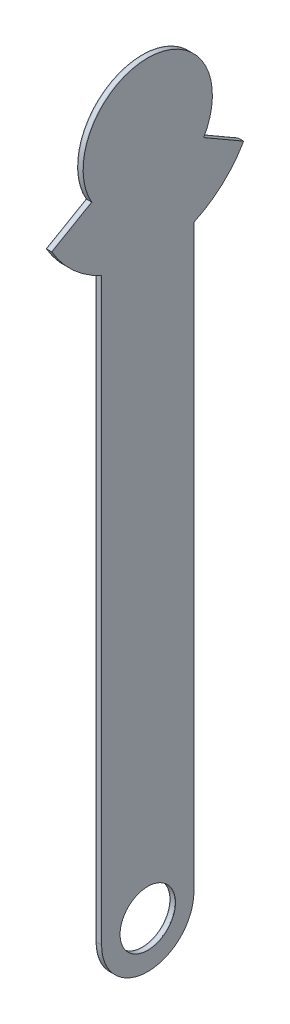
ISO-10303-21;
HEADER;
FILE_DESCRIPTION(('STEP AP214'),'2;1');
FILE_NAME('part.step','',(''),(''),'','','');
FILE_SCHEMA(('AUTOMOTIVE_DESIGN { 1 0 10303 214 1 1 1 1 }'));
ENDSEC;
DATA;
#1=APPLICATION_CONTEXT('core data for automotive mechanical design processes');
#2=APPLICATION_PROTOCOL_DEFINITION('international standard','automotive_design',2000,#1);
#3=PRODUCT_CONTEXT('',#1,'mechanical');
#4=PRODUCT('Part','Part','',(#3));
#5=PRODUCT_RELATED_PRODUCT_CATEGORY('part','',(#4));
#6=PRODUCT_DEFINITION_FORMATION('','',#4);
#7=PRODUCT_DEFINITION_CONTEXT('part definition',#1,'design');
#8=PRODUCT_DEFINITION('design','',#6,#7);
#9=PRODUCT_DEFINITION_SHAPE('','',#8);
#10=(LENGTH_UNIT() NAMED_UNIT(*) SI_UNIT(.MILLI.,.METRE.));
#11=(NAMED_UNIT(*) PLANE_ANGLE_UNIT() SI_UNIT($,.RADIAN.));
#12=(NAMED_UNIT(*) SI_UNIT($,.STERADIAN.) SOLID_ANGLE_UNIT());
#13=UNCERTAINTY_MEASURE_WITH_UNIT(LENGTH_MEASURE(1.E-05),#10,'distance_accuracy_value','');
#14=(GEOMETRIC_REPRESENTATION_CONTEXT(3) GLOBAL_UNCERTAINTY_ASSIGNED_CONTEXT((#13)) GLOBAL_UNIT_ASSIGNED_CONTEXT((#10,
#11,#12)) REPRESENTATION_CONTEXT('',''));
#15=CARTESIAN_POINT('',(0.,0.,0.));
#16=DIRECTION('',(0.,0.,1.));
#17=DIRECTION('',(1.,0.,0.));
#18=AXIS2_PLACEMENT_3D('',#15,#16,#17);
#19=CARTESIAN_POINT('',(-2.75,196.8,0.));
#20=DIRECTION('',(1.,0.,0.));
#21=DIRECTION('',(0.,0.,-1.));
#22=AXIS2_PLACEMENT_3D('',#19,#20,#21);
#23=CYLINDRICAL_SURFACE('',#22,60.);
#24=CARTESIAN_POINT('',(-2.5,196.8,0.));
#25=DIRECTION('',(-1.,0.,0.));
#26=DIRECTION('',(0.,0.,1.));
#27=AXIS2_PLACEMENT_3D('',#24,#25,#26);
#28=CIRCLE('',#27,60.);
#29=CARTESIAN_POINT('',(-2.5,142.256439426821,25.));
#30=VERTEX_POINT('',#29);
#31=CARTESIAN_POINT('',(-2.5,166.8,51.9615242270665));
#32=VERTEX_POINT('',#31);
#33=EDGE_CURVE('E160',#30,#32,#28,.T.);
#34=ORIENTED_EDGE('',*,*,#33,.T.);
#35=DIRECTION('',(1.,0.,0.));
#36=VECTOR('',#35,1.);
#37=CARTESIAN_POINT('',(-2.75,166.8,51.9615242270665));
#38=LINE('',#37,#36);
#39=CARTESIAN_POINT('',(-2.75,166.8,51.9615242270665));
#40=VERTEX_POINT('',#39);
#41=EDGE_CURVE('E12',#40,#32,#38,.T.);
#42=ORIENTED_EDGE('',*,*,#41,.F.);
#43=CARTESIAN_POINT('',(-2.75,196.8,0.));
#44=DIRECTION('',(-1.,0.,0.));
#45=DIRECTION('',(0.,0.,1.));
#46=AXIS2_PLACEMENT_3D('',#43,#44,#45);
#47=CIRCLE('',#46,60.);
#48=CARTESIAN_POINT('',(-2.75,142.256439426821,25.));
#49=VERTEX_POINT('',#48);
#50=EDGE_CURVE('E206',#49,#40,#47,.T.);
#51=ORIENTED_EDGE('',*,*,#50,.F.);
#52=DIRECTION('',(1.,0.,0.));
#53=VECTOR('',#52,1.);
#54=CARTESIAN_POINT('',(-2.75,142.256439426821,25.));
#55=LINE('',#54,#53);
#56=EDGE_CURVE('E153',#49,#30,#55,.T.);
#57=ORIENTED_EDGE('',*,*,#56,.T.);
#58=EDGE_LOOP('',(#34,#42,#51,#57));
#59=FACE_BOUND('',#58,.T.);
#60=ADVANCED_FACE('F60',(#59),#23,.T.);
#61=CARTESIAN_POINT('',(-2.75,147.600000000001,85.2168997323883));
#62=DIRECTION('',(0.,-0.866025403784441,-0.499999999999995));
#63=DIRECTION('',(0.,0.499999999999995,-0.866025403784442));
#64=AXIS2_PLACEMENT_3D('',#61,#62,#63);
#65=PLANE('',#64);
#66=DIRECTION('',(0.,0.499999999999995,-0.866025403784442));
#67=VECTOR('',#66,1.);
#68=CARTESIAN_POINT('',(-2.5,147.600000000001,85.2168997323883));
#69=LINE('',#68,#67);
#70=CARTESIAN_POINT('',(-2.5,179.3,30.3108891324555));
#71=VERTEX_POINT('',#70);
#72=EDGE_CURVE('E163',#32,#71,#69,.T.);
#73=ORIENTED_EDGE('',*,*,#72,.T.);
#74=DIRECTION('',(1.,0.,0.));
#75=VECTOR('',#74,1.);
#76=CARTESIAN_POINT('',(-2.75,179.3,30.3108891324555));
#77=LINE('',#76,#75);
#78=CARTESIAN_POINT('',(-2.75,179.3,30.3108891324555));
#79=VERTEX_POINT('',#78);
#80=EDGE_CURVE('E69',#79,#71,#77,.T.);
#81=ORIENTED_EDGE('',*,*,#80,.F.);
#82=DIRECTION('',(0.,0.499999999999995,-0.866025403784442));
#83=VECTOR('',#82,1.);
#84=CARTESIAN_POINT('',(-2.75,147.600000000001,85.2168997323883));
#85=LINE('',#84,#83);
#86=EDGE_CURVE('E120',#40,#79,#85,.T.);
#87=ORIENTED_EDGE('',*,*,#86,.F.);
#88=ORIENTED_EDGE('',*,*,#41,.T.);
#89=EDGE_LOOP('',(#73,#81,#87,#88));
#90=FACE_BOUND('',#89,.T.);
#91=ADVANCED_FACE('F225',(#90),#65,.F.);
#92=CARTESIAN_POINT('',(-2.75,196.8,0.));
#93=DIRECTION('',(1.,0.,0.));
#94=DIRECTION('',(0.,0.,-1.));
#95=AXIS2_PLACEMENT_3D('',#92,#93,#94);
#96=CYLINDRICAL_SURFACE('',#95,35.);
#97=CARTESIAN_POINT('',(-2.5,196.8,0.));
#98=DIRECTION('',(-1.,0.,0.));
#99=DIRECTION('',(0.,0.,1.));
#100=AXIS2_PLACEMENT_3D('',#97,#98,#99);
#101=CIRCLE('',#100,35.);
#102=CARTESIAN_POINT('',(-2.5,179.3,-30.3108891324553));
#103=VERTEX_POINT('',#102);
#104=EDGE_CURVE('E165',#71,#103,#101,.T.);
#105=ORIENTED_EDGE('',*,*,#104,.T.);
#106=DIRECTION('',(1.,0.,0.));
#107=VECTOR('',#106,1.);
#108=CARTESIAN_POINT('',(-2.75,179.3,-30.3108891324553));
#109=LINE('',#108,#107);
#110=CARTESIAN_POINT('',(-2.75,179.3,-30.3108891324553));
#111=VERTEX_POINT('',#110);
#112=EDGE_CURVE('E181',#111,#103,#109,.T.);
#113=ORIENTED_EDGE('',*,*,#112,.F.);
#114=CARTESIAN_POINT('',(-2.75,196.8,0.));
#115=DIRECTION('',(-1.,0.,0.));
#116=DIRECTION('',(0.,0.,1.));
#117=AXIS2_PLACEMENT_3D('',#114,#115,#116);
#118=CIRCLE('',#117,35.);
#119=EDGE_CURVE('E189',#79,#111,#118,.T.);
#120=ORIENTED_EDGE('',*,*,#119,.F.);
#121=ORIENTED_EDGE('',*,*,#80,.T.);
#122=EDGE_LOOP('',(#105,#113,#120,#121));
#123=FACE_BOUND('',#122,.T.);
#124=ADVANCED_FACE('F187',(#123),#96,.T.);
#125=CARTESIAN_POINT('',(-2.75,147.6,-85.2168997323889));
#126=DIRECTION('',(0.,-0.866025403784438,0.500000000000001));
#127=DIRECTION('',(0.,-0.500000000000001,-0.866025403784438));
#128=AXIS2_PLACEMENT_3D('',#125,#126,#127);
#129=PLANE('',#128);
#130=DIRECTION('',(0.,-0.500000000000001,-0.866025403784438));
#131=VECTOR('',#130,1.);
#132=CARTESIAN_POINT('',(-2.5,147.6,-85.2168997323889));
#133=LINE('',#132,#131);
#134=CARTESIAN_POINT('',(-2.5,166.8,-51.9615242270663));
#135=VERTEX_POINT('',#134);
#136=EDGE_CURVE('E167',#103,#135,#133,.T.);
#137=ORIENTED_EDGE('',*,*,#136,.T.);
#138=DIRECTION('',(1.,0.,0.));
#139=VECTOR('',#138,1.);
#140=CARTESIAN_POINT('',(-2.75,166.8,-51.9615242270663));
#141=LINE('',#140,#139);
#142=CARTESIAN_POINT('',(-2.75,166.8,-51.9615242270663));
#143=VERTEX_POINT('',#142);
#144=EDGE_CURVE('E178',#143,#135,#141,.T.);
#145=ORIENTED_EDGE('',*,*,#144,.F.);
#146=DIRECTION('',(0.,-0.500000000000001,-0.866025403784438));
#147=VECTOR('',#146,1.);
#148=CARTESIAN_POINT('',(-2.75,147.6,-85.2168997323889));
#149=LINE('',#148,#147);
#150=EDGE_CURVE('E201',#111,#143,#149,.T.);
#151=ORIENTED_EDGE('',*,*,#150,.F.);
#152=ORIENTED_EDGE('',*,*,#112,.T.);
#153=EDGE_LOOP('',(#137,#145,#151,#152));
#154=FACE_BOUND('',#153,.T.);
#155=ADVANCED_FACE('F197',(#154),#129,.F.);
#156=CARTESIAN_POINT('',(-2.75,196.8,0.));
#157=DIRECTION('',(1.,0.,0.));
#158=DIRECTION('',(0.,0.,-1.));
#159=AXIS2_PLACEMENT_3D('',#156,#157,#158);
#160=CYLINDRICAL_SURFACE('',#159,60.);
#161=CARTESIAN_POINT('',(-2.5,196.8,0.));
#162=DIRECTION('',(-1.,0.,0.));
#163=DIRECTION('',(0.,0.,1.));
#164=AXIS2_PLACEMENT_3D('',#161,#162,#163);
#165=CIRCLE('',#164,60.);
#166=CARTESIAN_POINT('',(-2.5,142.256439426821,-25.));
#167=VERTEX_POINT('',#166);
#168=EDGE_CURVE('E169',#135,#167,#165,.T.);
#169=ORIENTED_EDGE('',*,*,#168,.T.);
#170=DIRECTION('',(1.,0.,0.));
#171=VECTOR('',#170,1.);
#172=CARTESIAN_POINT('',(-2.75,142.256439426821,-25.));
#173=LINE('',#172,#171);
#174=CARTESIAN_POINT('',(-2.75,142.256439426821,-25.));
#175=VERTEX_POINT('',#174);
#176=EDGE_CURVE('E148',#175,#167,#173,.T.);
#177=ORIENTED_EDGE('',*,*,#176,.F.);
#178=CARTESIAN_POINT('',(-2.75,196.8,0.));
#179=DIRECTION('',(-1.,0.,0.));
#180=DIRECTION('',(0.,0.,1.));
#181=AXIS2_PLACEMENT_3D('',#178,#179,#180);
#182=CIRCLE('',#181,60.);
#183=EDGE_CURVE('E139',#143,#175,#182,.T.);
#184=ORIENTED_EDGE('',*,*,#183,.F.);
#185=ORIENTED_EDGE('',*,*,#144,.T.);
#186=EDGE_LOOP('',(#169,#177,#184,#185));
#187=FACE_BOUND('',#186,.T.);
#188=ADVANCED_FACE('F200',(#187),#160,.T.);
#189=CARTESIAN_POINT('',(-2.75,0.,-25.));
#190=DIRECTION('',(0.,0.,1.));
#191=DIRECTION('',(1.,0.,0.));
#192=AXIS2_PLACEMENT_3D('',#189,#190,#191);
#193=PLANE('',#192);
#194=DIRECTION('',(0.,-1.,0.));
#195=VECTOR('',#194,1.);
#196=CARTESIAN_POINT('',(-2.5,0.,-25.));
#197=LINE('',#196,#195);
#198=CARTESIAN_POINT('',(-2.5,-171.8,-25.));
#199=VERTEX_POINT('',#198);
#200=EDGE_CURVE('E147',#167,#199,#197,.T.);
#201=ORIENTED_EDGE('',*,*,#200,.T.);
#202=DIRECTION('',(1.,0.,0.));
#203=VECTOR('',#202,1.);
#204=CARTESIAN_POINT('',(-2.75,-171.8,-25.));
#205=LINE('',#204,#203);
#206=CARTESIAN_POINT('',(-2.75,-171.8,-25.));
#207=VERTEX_POINT('',#206);
#208=EDGE_CURVE('E144',#207,#199,#205,.T.);
#209=ORIENTED_EDGE('',*,*,#208,.F.);
#210=DIRECTION('',(0.,-1.,0.));
#211=VECTOR('',#210,1.);
#212=CARTESIAN_POINT('',(-2.75,0.,-25.));
#213=LINE('',#212,#211);
#214=EDGE_CURVE('E133',#175,#207,#213,.T.);
#215=ORIENTED_EDGE('',*,*,#214,.F.);
#216=ORIENTED_EDGE('',*,*,#176,.T.);
#217=EDGE_LOOP('',(#201,#209,#215,#216));
#218=FACE_BOUND('',#217,.T.);
#219=ADVANCED_FACE('F145',(#218),#193,.F.);
#220=CARTESIAN_POINT('',(-2.75,-171.8,0.));
#221=DIRECTION('',(1.,0.,0.));
#222=DIRECTION('',(0.,0.,-1.));
#223=AXIS2_PLACEMENT_3D('',#220,#221,#222);
#224=CYLINDRICAL_SURFACE('',#223,25.);
#225=CARTESIAN_POINT('',(-2.5,-171.8,0.));
#226=DIRECTION('',(-1.,0.,0.));
#227=DIRECTION('',(0.,0.,1.));
#228=AXIS2_PLACEMENT_3D('',#225,#226,#227);
#229=CIRCLE('',#228,25.);
#230=CARTESIAN_POINT('',(-2.5,-171.8,25.));
#231=VERTEX_POINT('',#230);
#232=EDGE_CURVE('E106',#199,#231,#229,.T.);
#233=ORIENTED_EDGE('',*,*,#232,.T.);
#234=DIRECTION('',(1.,0.,0.));
#235=VECTOR('',#234,1.);
#236=CARTESIAN_POINT('',(-2.75,-171.8,25.));
#237=LINE('',#236,#235);
#238=CARTESIAN_POINT('',(-2.75,-171.8,25.));
#239=VERTEX_POINT('',#238);
#240=EDGE_CURVE('E149',#239,#231,#237,.T.);
#241=ORIENTED_EDGE('',*,*,#240,.F.);
#242=CARTESIAN_POINT('',(-2.75,-171.8,0.));
#243=DIRECTION('',(-1.,0.,0.));
#244=DIRECTION('',(0.,0.,1.));
#245=AXIS2_PLACEMENT_3D('',#242,#243,#244);
#246=CIRCLE('',#245,25.);
#247=EDGE_CURVE('E137',#207,#239,#246,.T.);
#248=ORIENTED_EDGE('',*,*,#247,.F.);
#249=ORIENTED_EDGE('',*,*,#208,.T.);
#250=EDGE_LOOP('',(#233,#241,#248,#249));
#251=FACE_BOUND('',#250,.T.);
#252=ADVANCED_FACE('F151',(#251),#224,.T.);
#253=CARTESIAN_POINT('',(-2.75,-171.8,0.));
#254=DIRECTION('',(1.,0.,0.));
#255=DIRECTION('',(0.,0.,-1.));
#256=AXIS2_PLACEMENT_3D('',#253,#254,#255);
#257=CYLINDRICAL_SURFACE('',#256,15.);
#258=CARTESIAN_POINT('',(-2.75,-171.8,0.));
#259=DIRECTION('',(-1.,0.,0.));
#260=DIRECTION('',(0.,0.,1.));
#261=AXIS2_PLACEMENT_3D('',#258,#259,#260);
#262=CIRCLE('',#261,15.);
#263=CARTESIAN_POINT('',(-2.75,-171.8,15.));
#264=VERTEX_POINT('',#263);
#265=EDGE_CURVE('E174',#264,#264,#262,.F.);
#266=ORIENTED_EDGE('',*,*,#265,.F.);
#267=EDGE_LOOP('',(#266));
#268=FACE_BOUND('',#267,.T.);
#269=CARTESIAN_POINT('',(-2.5,-171.8,0.));
#270=DIRECTION('',(-1.,0.,0.));
#271=DIRECTION('',(0.,0.,1.));
#272=AXIS2_PLACEMENT_3D('',#269,#270,#271);
#273=CIRCLE('',#272,15.);
#274=CARTESIAN_POINT('',(-2.5,-171.8,15.));
#275=VERTEX_POINT('',#274);
#276=EDGE_CURVE('E157',#275,#275,#273,.F.);
#277=ORIENTED_EDGE('',*,*,#276,.T.);
#278=EDGE_LOOP('',(#277));
#279=FACE_BOUND('',#278,.T.);
#280=ADVANCED_FACE('F62',(#268,#279),#257,.F.);
#281=CARTESIAN_POINT('',(-2.75,0.,25.));
#282=DIRECTION('',(0.,0.,-1.));
#283=DIRECTION('',(-1.,0.,0.));
#284=AXIS2_PLACEMENT_3D('',#281,#282,#283);
#285=PLANE('',#284);
#286=DIRECTION('',(0.,1.,0.));
#287=VECTOR('',#286,1.);
#288=CARTESIAN_POINT('',(-2.5,0.,25.));
#289=LINE('',#288,#287);
#290=EDGE_CURVE('E112',#231,#30,#289,.T.);
#291=ORIENTED_EDGE('',*,*,#290,.T.);
#292=ORIENTED_EDGE('',*,*,#56,.F.);
#293=DIRECTION('',(0.,1.,0.));
#294=VECTOR('',#293,1.);
#295=CARTESIAN_POINT('',(-2.75,0.,25.));
#296=LINE('',#295,#294);
#297=EDGE_CURVE('E77',#239,#49,#296,.T.);
#298=ORIENTED_EDGE('',*,*,#297,.F.);
#299=ORIENTED_EDGE('',*,*,#240,.T.);
#300=EDGE_LOOP('',(#291,#292,#298,#299));
#301=FACE_BOUND('',#300,.T.);
#302=ADVANCED_FACE('F214',(#301),#285,.F.);
#303=CARTESIAN_POINT('',(-2.75,0.,0.));
#304=DIRECTION('',(-1.,0.,0.));
#305=DIRECTION('',(0.,0.,1.));
#306=AXIS2_PLACEMENT_3D('',#303,#304,#305);
#307=PLANE('',#306);
#308=ORIENTED_EDGE('',*,*,#265,.T.);
#309=EDGE_LOOP('',(#308));
#310=FACE_BOUND('',#309,.T.);
#311=ORIENTED_EDGE('',*,*,#50,.T.);
#312=ORIENTED_EDGE('',*,*,#86,.T.);
#313=ORIENTED_EDGE('',*,*,#119,.T.);
#314=ORIENTED_EDGE('',*,*,#150,.T.);
#315=ORIENTED_EDGE('',*,*,#183,.T.);
#316=ORIENTED_EDGE('',*,*,#214,.T.);
#317=ORIENTED_EDGE('',*,*,#247,.T.);
#318=ORIENTED_EDGE('',*,*,#297,.T.);
#319=EDGE_LOOP('',(#311,#312,#313,#314,#315,#316,#317,#318));
#320=FACE_BOUND('',#319,.T.);
#321=ADVANCED_FACE('F135',(#310,#320),#307,.T.);
#322=CARTESIAN_POINT('',(-2.5,0.,0.));
#323=DIRECTION('',(-1.,0.,0.));
#324=DIRECTION('',(0.,0.,1.));
#325=AXIS2_PLACEMENT_3D('',#322,#323,#324);
#326=PLANE('',#325);
#327=ORIENTED_EDGE('',*,*,#276,.F.);
#328=EDGE_LOOP('',(#327));
#329=FACE_BOUND('',#328,.T.);
#330=ORIENTED_EDGE('',*,*,#33,.F.);
#331=ORIENTED_EDGE('',*,*,#290,.F.);
#332=ORIENTED_EDGE('',*,*,#232,.F.);
#333=ORIENTED_EDGE('',*,*,#200,.F.);
#334=ORIENTED_EDGE('',*,*,#168,.F.);
#335=ORIENTED_EDGE('',*,*,#136,.F.);
#336=ORIENTED_EDGE('',*,*,#104,.F.);
#337=ORIENTED_EDGE('',*,*,#72,.F.);
#338=EDGE_LOOP('',(#330,#331,#332,#333,#334,#335,#336,#337));
#339=FACE_BOUND('',#338,.T.);
#340=ADVANCED_FACE('F193',(#329,#339),#326,.F.);
#341=CLOSED_SHELL('',(#60,#91,#124,#155,#188,#219,#252,#280,#302,#321,#340));
#342=MANIFOLD_SOLID_BREP('B2',#341);
#343=CARTESIAN_POINT('',(-2.5,147.600000000001,85.2168997323882));
#344=DIRECTION('',(0.,-0.866025403784442,-0.499999999999995));
#345=DIRECTION('',(0.,0.499999999999995,-0.866025403784442));
#346=AXIS2_PLACEMENT_3D('',#343,#344,#345);
#347=PLANE('',#346);
#348=DIRECTION('',(0.,0.499999999999995,-0.866025403784442));
#349=VECTOR('',#348,1.);
#350=CARTESIAN_POINT('',(0.,147.600000000001,85.2168997323882));
#351=LINE('',#350,#349);
#352=CARTESIAN_POINT('',(0.,166.8,51.9615242270665));
#353=VERTEX_POINT('',#352);
#354=CARTESIAN_POINT('',(0.,179.3,30.3108891324555));
#355=VERTEX_POINT('',#354);
#356=EDGE_CURVE('E427',#353,#355,#351,.T.);
#357=ORIENTED_EDGE('',*,*,#356,.T.);
#358=DIRECTION('',(1.,0.,0.));
#359=VECTOR('',#358,1.);
#360=CARTESIAN_POINT('',(-2.5,179.3,30.3108891324555));
#361=LINE('',#360,#359);
#362=CARTESIAN_POINT('',(-2.5,179.3,30.3108891324555));
#363=VERTEX_POINT('',#362);
#364=EDGE_CURVE('E58',#363,#355,#361,.T.);
#365=ORIENTED_EDGE('',*,*,#364,.F.);
#366=DIRECTION('',(0.,0.499999999999995,-0.866025403784442));
#367=VECTOR('',#366,1.);
#368=CARTESIAN_POINT('',(-2.5,147.600000000001,85.2168997323882));
#369=LINE('',#368,#367);
#370=CARTESIAN_POINT('',(-2.5,166.8,51.9615242270665));
#371=VERTEX_POINT('',#370);
#372=EDGE_CURVE('E453',#371,#363,#369,.T.);
#373=ORIENTED_EDGE('',*,*,#372,.F.);
#374=DIRECTION('',(1.,0.,0.));
#375=VECTOR('',#374,1.);
#376=CARTESIAN_POINT('',(-2.5,166.8,51.9615242270665));
#377=LINE('',#376,#375);
#378=EDGE_CURVE('E426',#371,#353,#377,.T.);
#379=ORIENTED_EDGE('',*,*,#378,.T.);
#380=EDGE_LOOP('',(#357,#365,#373,#379));
#381=FACE_BOUND('',#380,.T.);
#382=ADVANCED_FACE('F321',(#381),#347,.F.);
#383=CARTESIAN_POINT('',(-2.5,196.8,0.));
#384=DIRECTION('',(1.,0.,0.));
#385=DIRECTION('',(0.,0.,-1.));
#386=AXIS2_PLACEMENT_3D('',#383,#384,#385);
#387=CYLINDRICAL_SURFACE('',#386,35.);
#388=CARTESIAN_POINT('',(0.,196.8,0.));
#389=DIRECTION('',(-1.,0.,0.));
#390=DIRECTION('',(0.,0.,1.));
#391=AXIS2_PLACEMENT_3D('',#388,#389,#390);
#392=CIRCLE('',#391,35.);
#393=CARTESIAN_POINT('',(0.,179.3,-30.3108891324553));
#394=VERTEX_POINT('',#393);
#395=EDGE_CURVE('E431',#355,#394,#392,.T.);
#396=ORIENTED_EDGE('',*,*,#395,.T.);
#397=DIRECTION('',(1.,0.,0.));
#398=VECTOR('',#397,1.);
#399=CARTESIAN_POINT('',(-2.5,179.3,-30.3108891324553));
#400=LINE('',#399,#398);
#401=CARTESIAN_POINT('',(-2.5,179.3,-30.3108891324553));
#402=VERTEX_POINT('',#401);
#403=EDGE_CURVE('E330',#402,#394,#400,.T.);
#404=ORIENTED_EDGE('',*,*,#403,.F.);
#405=CARTESIAN_POINT('',(-2.5,196.8,0.));
#406=DIRECTION('',(-1.,0.,0.));
#407=DIRECTION('',(0.,0.,1.));
#408=AXIS2_PLACEMENT_3D('',#405,#406,#407);
#409=CIRCLE('',#408,35.);
#410=EDGE_CURVE('E381',#363,#402,#409,.T.);
#411=ORIENTED_EDGE('',*,*,#410,.F.);
#412=ORIENTED_EDGE('',*,*,#364,.T.);
#413=EDGE_LOOP('',(#396,#404,#411,#412));
#414=FACE_BOUND('',#413,.T.);
#415=ADVANCED_FACE('F500',(#414),#387,.T.);
#416=CARTESIAN_POINT('',(-2.5,147.6,-85.2168997323889));
#417=DIRECTION('',(0.,-0.866025403784438,0.500000000000001));
#418=DIRECTION('',(0.,-0.500000000000001,-0.866025403784438));
#419=AXIS2_PLACEMENT_3D('',#416,#417,#418);
#420=PLANE('',#419);
#421=DIRECTION('',(0.,-0.500000000000001,-0.866025403784438));
#422=VECTOR('',#421,1.);
#423=CARTESIAN_POINT('',(0.,147.6,-85.2168997323889));
#424=LINE('',#423,#422);
#425=CARTESIAN_POINT('',(0.,166.8,-51.9615242270663));
#426=VERTEX_POINT('',#425);
#427=EDGE_CURVE('E434',#394,#426,#424,.T.);
#428=ORIENTED_EDGE('',*,*,#427,.T.);
#429=DIRECTION('',(1.,0.,0.));
#430=VECTOR('',#429,1.);
#431=CARTESIAN_POINT('',(-2.5,166.8,-51.9615242270663));
#432=LINE('',#431,#430);
#433=CARTESIAN_POINT('',(-2.5,166.8,-51.9615242270663));
#434=VERTEX_POINT('',#433);
#435=EDGE_CURVE('E464',#434,#426,#432,.T.);
#436=ORIENTED_EDGE('',*,*,#435,.F.);
#437=DIRECTION('',(0.,-0.500000000000001,-0.866025403784438));
#438=VECTOR('',#437,1.);
#439=CARTESIAN_POINT('',(-2.5,147.6,-85.2168997323889));
#440=LINE('',#439,#438);
#441=EDGE_CURVE('E474',#402,#434,#440,.T.);
#442=ORIENTED_EDGE('',*,*,#441,.F.);
#443=ORIENTED_EDGE('',*,*,#403,.T.);
#444=EDGE_LOOP('',(#428,#436,#442,#443));
#445=FACE_BOUND('',#444,.T.);
#446=ADVANCED_FACE('F472',(#445),#420,.F.);
#447=CARTESIAN_POINT('',(-2.5,196.8,0.));
#448=DIRECTION('',(1.,0.,0.));
#449=DIRECTION('',(0.,0.,-1.));
#450=AXIS2_PLACEMENT_3D('',#447,#448,#449);
#451=CYLINDRICAL_SURFACE('',#450,60.);
#452=CARTESIAN_POINT('',(0.,196.8,0.));
#453=DIRECTION('',(-1.,0.,0.));
#454=DIRECTION('',(0.,0.,1.));
#455=AXIS2_PLACEMENT_3D('',#452,#453,#454);
#456=CIRCLE('',#455,60.);
#457=CARTESIAN_POINT('',(0.,142.256439426821,-25.));
#458=VERTEX_POINT('',#457);
#459=EDGE_CURVE('E437',#426,#458,#456,.T.);
#460=ORIENTED_EDGE('',*,*,#459,.T.);
#461=DIRECTION('',(1.,0.,0.));
#462=VECTOR('',#461,1.);
#463=CARTESIAN_POINT('',(-2.5,142.256439426821,-25.));
#464=LINE('',#463,#462);
#465=CARTESIAN_POINT('',(-2.5,142.256439426821,-25.));
#466=VERTEX_POINT('',#465);
#467=EDGE_CURVE('E460',#466,#458,#464,.T.);
#468=ORIENTED_EDGE('',*,*,#467,.F.);
#469=CARTESIAN_POINT('',(-2.5,196.8,0.));
#470=DIRECTION('',(-1.,0.,0.));
#471=DIRECTION('',(0.,0.,1.));
#472=AXIS2_PLACEMENT_3D('',#469,#470,#471);
#473=CIRCLE('',#472,60.);
#474=EDGE_CURVE('E488',#434,#466,#473,.T.);
#475=ORIENTED_EDGE('',*,*,#474,.F.);
#476=ORIENTED_EDGE('',*,*,#435,.T.);
#477=EDGE_LOOP('',(#460,#468,#475,#476));
#478=FACE_BOUND('',#477,.T.);
#479=ADVANCED_FACE('F483',(#478),#451,.T.);
#480=CARTESIAN_POINT('',(-2.5,0.,-25.));
#481=DIRECTION('',(0.,0.,1.));
#482=DIRECTION('',(1.,0.,0.));
#483=AXIS2_PLACEMENT_3D('',#480,#481,#482);
#484=PLANE('',#483);
#485=DIRECTION('',(0.,-1.,0.));
#486=VECTOR('',#485,1.);
#487=CARTESIAN_POINT('',(0.,0.,-25.));
#488=LINE('',#487,#486);
#489=CARTESIAN_POINT('',(0.,-171.8,-25.));
#490=VERTEX_POINT('',#489);
#491=EDGE_CURVE('E440',#458,#490,#488,.T.);
#492=ORIENTED_EDGE('',*,*,#491,.T.);
#493=DIRECTION('',(1.,0.,0.));
#494=VECTOR('',#493,1.);
#495=CARTESIAN_POINT('',(-2.5,-171.8,-25.));
#496=LINE('',#495,#494);
#497=CARTESIAN_POINT('',(-2.5,-171.8,-25.));
#498=VERTEX_POINT('',#497);
#499=EDGE_CURVE('E412',#498,#490,#496,.T.);
#500=ORIENTED_EDGE('',*,*,#499,.F.);
#501=DIRECTION('',(0.,-1.,0.));
#502=VECTOR('',#501,1.);
#503=CARTESIAN_POINT('',(-2.5,0.,-25.));
#504=LINE('',#503,#502);
#505=EDGE_CURVE('E401',#466,#498,#504,.T.);
#506=ORIENTED_EDGE('',*,*,#505,.F.);
#507=ORIENTED_EDGE('',*,*,#467,.T.);
#508=EDGE_LOOP('',(#492,#500,#506,#507));
#509=FACE_BOUND('',#508,.T.);
#510=ADVANCED_FACE('F486',(#509),#484,.F.);
#511=CARTESIAN_POINT('',(-2.5,-171.8,0.));
#512=DIRECTION('',(1.,0.,0.));
#513=DIRECTION('',(0.,0.,-1.));
#514=AXIS2_PLACEMENT_3D('',#511,#512,#513);
#515=CYLINDRICAL_SURFACE('',#514,25.);
#516=CARTESIAN_POINT('',(0.,-171.8,0.));
#517=DIRECTION('',(-1.,0.,0.));
#518=DIRECTION('',(0.,0.,1.));
#519=AXIS2_PLACEMENT_3D('',#516,#517,#518);
#520=CIRCLE('',#519,25.);
#521=CARTESIAN_POINT('',(0.,-171.8,25.));
#522=VERTEX_POINT('',#521);
#523=EDGE_CURVE('E410',#490,#522,#520,.T.);
#524=ORIENTED_EDGE('',*,*,#523,.T.);
#525=DIRECTION('',(1.,0.,0.));
#526=VECTOR('',#525,1.);
#527=CARTESIAN_POINT('',(-2.5,-171.8,25.));
#528=LINE('',#527,#526);
#529=CARTESIAN_POINT('',(-2.5,-171.8,25.));
#530=VERTEX_POINT('',#529);
#531=EDGE_CURVE('E407',#530,#522,#528,.T.);
#532=ORIENTED_EDGE('',*,*,#531,.F.);
#533=CARTESIAN_POINT('',(-2.5,-171.8,0.));
#534=DIRECTION('',(-1.,0.,0.));
#535=DIRECTION('',(0.,0.,1.));
#536=AXIS2_PLACEMENT_3D('',#533,#534,#535);
#537=CIRCLE('',#536,25.);
#538=EDGE_CURVE('E394',#498,#530,#537,.T.);
#539=ORIENTED_EDGE('',*,*,#538,.F.);
#540=ORIENTED_EDGE('',*,*,#499,.T.);
#541=EDGE_LOOP('',(#524,#532,#539,#540));
#542=FACE_BOUND('',#541,.T.);
#543=ADVANCED_FACE('F408',(#542),#515,.T.);
#544=CARTESIAN_POINT('',(-2.5,0.,25.));
#545=DIRECTION('',(0.,0.,-1.));
#546=DIRECTION('',(-1.,0.,0.));
#547=AXIS2_PLACEMENT_3D('',#544,#545,#546);
#548=PLANE('',#547);
#549=DIRECTION('',(0.,1.,0.));
#550=VECTOR('',#549,1.);
#551=CARTESIAN_POINT('',(0.,0.,25.));
#552=LINE('',#551,#550);
#553=CARTESIAN_POINT('',(0.,142.256439426821,25.));
#554=VERTEX_POINT('',#553);
#555=EDGE_CURVE('E367',#522,#554,#552,.T.);
#556=ORIENTED_EDGE('',*,*,#555,.T.);
#557=DIRECTION('',(1.,0.,0.));
#558=VECTOR('',#557,1.);
#559=CARTESIAN_POINT('',(-2.5,142.256439426821,25.));
#560=LINE('',#559,#558);
#561=CARTESIAN_POINT('',(-2.5,142.256439426821,25.));
#562=VERTEX_POINT('',#561);
#563=EDGE_CURVE('E413',#562,#554,#560,.T.);
#564=ORIENTED_EDGE('',*,*,#563,.F.);
#565=DIRECTION('',(0.,1.,0.));
#566=VECTOR('',#565,1.);
#567=CARTESIAN_POINT('',(-2.5,0.,25.));
#568=LINE('',#567,#566);
#569=EDGE_CURVE('E399',#530,#562,#568,.T.);
#570=ORIENTED_EDGE('',*,*,#569,.F.);
#571=ORIENTED_EDGE('',*,*,#531,.T.);
#572=EDGE_LOOP('',(#556,#564,#570,#571));
#573=FACE_BOUND('',#572,.T.);
#574=ADVANCED_FACE('F415',(#573),#548,.F.);
#575=CARTESIAN_POINT('',(-2.5,196.8,0.));
#576=DIRECTION('',(1.,0.,0.));
#577=DIRECTION('',(0.,0.,-1.));
#578=AXIS2_PLACEMENT_3D('',#575,#576,#577);
#579=CYLINDRICAL_SURFACE('',#578,60.);
#580=CARTESIAN_POINT('',(0.,196.8,0.));
#581=DIRECTION('',(-1.,0.,0.));
#582=DIRECTION('',(0.,0.,1.));
#583=AXIS2_PLACEMENT_3D('',#580,#581,#582);
#584=CIRCLE('',#583,60.);
#585=EDGE_CURVE('E373',#554,#353,#584,.T.);
#586=ORIENTED_EDGE('',*,*,#585,.T.);
#587=ORIENTED_EDGE('',*,*,#378,.F.);
#588=CARTESIAN_POINT('',(-2.5,196.8,0.));
#589=DIRECTION('',(-1.,0.,0.));
#590=DIRECTION('',(0.,0.,1.));
#591=AXIS2_PLACEMENT_3D('',#588,#589,#590);
#592=CIRCLE('',#591,60.);
#593=EDGE_CURVE('E338',#562,#371,#592,.T.);
#594=ORIENTED_EDGE('',*,*,#593,.F.);
#595=ORIENTED_EDGE('',*,*,#563,.T.);
#596=EDGE_LOOP('',(#586,#587,#594,#595));
#597=FACE_BOUND('',#596,.T.);
#598=ADVANCED_FACE('F516',(#597),#579,.T.);
#599=CARTESIAN_POINT('',(-2.5,-171.8,0.));
#600=DIRECTION('',(1.,0.,0.));
#601=DIRECTION('',(0.,0.,-1.));
#602=AXIS2_PLACEMENT_3D('',#599,#600,#601);
#603=CYLINDRICAL_SURFACE('',#602,15.);
#604=CARTESIAN_POINT('',(-2.5,-171.8,0.));
#605=DIRECTION('',(-1.,0.,0.));
#606=DIRECTION('',(0.,0.,1.));
#607=AXIS2_PLACEMENT_3D('',#604,#605,#606);
#608=CIRCLE('',#607,15.);
#609=CARTESIAN_POINT('',(-2.5,-171.8,15.));
#610=VERTEX_POINT('',#609);
#611=EDGE_CURVE('E419',#610,#610,#608,.F.);
#612=ORIENTED_EDGE('',*,*,#611,.F.);
#613=EDGE_LOOP('',(#612));
#614=FACE_BOUND('',#613,.T.);
#615=CARTESIAN_POINT('',(0.,-171.8,0.));
#616=DIRECTION('',(-1.,0.,0.));
#617=DIRECTION('',(0.,0.,1.));
#618=AXIS2_PLACEMENT_3D('',#615,#616,#617);
#619=CIRCLE('',#618,15.);
#620=CARTESIAN_POINT('',(0.,-171.8,15.));
#621=VERTEX_POINT('',#620);
#622=EDGE_CURVE('E449',#621,#621,#619,.F.);
#623=ORIENTED_EDGE('',*,*,#622,.T.);
#624=EDGE_LOOP('',(#623));
#625=FACE_BOUND('',#624,.T.);
#626=ADVANCED_FACE('F519',(#614,#625),#603,.F.);
#627=CARTESIAN_POINT('',(-2.5,0.,0.));
#628=DIRECTION('',(-1.,0.,0.));
#629=DIRECTION('',(0.,0.,1.));
#630=AXIS2_PLACEMENT_3D('',#627,#628,#629);
#631=PLANE('',#630);
#632=ORIENTED_EDGE('',*,*,#372,.T.);
#633=ORIENTED_EDGE('',*,*,#410,.T.);
#634=ORIENTED_EDGE('',*,*,#441,.T.);
#635=ORIENTED_EDGE('',*,*,#474,.T.);
#636=ORIENTED_EDGE('',*,*,#505,.T.);
#637=ORIENTED_EDGE('',*,*,#538,.T.);
#638=ORIENTED_EDGE('',*,*,#569,.T.);
#639=ORIENTED_EDGE('',*,*,#593,.T.);
#640=EDGE_LOOP('',(#632,#633,#634,#635,#636,#637,#638,#639));
#641=FACE_BOUND('',#640,.T.);
#642=ORIENTED_EDGE('',*,*,#611,.T.);
#643=EDGE_LOOP('',(#642));
#644=FACE_BOUND('',#643,.T.);
#645=ADVANCED_FACE('F396',(#641,#644),#631,.T.);
#646=CARTESIAN_POINT('',(0.,0.,0.));
#647=DIRECTION('',(-1.,0.,0.));
#648=DIRECTION('',(0.,0.,1.));
#649=AXIS2_PLACEMENT_3D('',#646,#647,#648);
#650=PLANE('',#649);
#651=ORIENTED_EDGE('',*,*,#356,.F.);
#652=ORIENTED_EDGE('',*,*,#585,.F.);
#653=ORIENTED_EDGE('',*,*,#555,.F.);
#654=ORIENTED_EDGE('',*,*,#523,.F.);
#655=ORIENTED_EDGE('',*,*,#491,.F.);
#656=ORIENTED_EDGE('',*,*,#459,.F.);
#657=ORIENTED_EDGE('',*,*,#427,.F.);
#658=ORIENTED_EDGE('',*,*,#395,.F.);
#659=EDGE_LOOP('',(#651,#652,#653,#654,#655,#656,#657,#658));
#660=FACE_BOUND('',#659,.T.);
#661=ORIENTED_EDGE('',*,*,#622,.F.);
#662=EDGE_LOOP('',(#661));
#663=FACE_BOUND('',#662,.T.);
#664=ADVANCED_FACE('F478',(#660,#663),#650,.F.);
#665=CLOSED_SHELL('',(#382,#415,#446,#479,#510,#543,#574,#598,#626,#645,#664));
#666=MANIFOLD_SOLID_BREP('B6',#665);
#667=CARTESIAN_POINT('',(0.25,196.8,0.));
#668=DIRECTION('',(-1.,0.,0.));
#669=DIRECTION('',(0.,0.,1.));
#670=AXIS2_PLACEMENT_3D('',#667,#668,#669);
#671=CYLINDRICAL_SURFACE('',#670,35.);
#672=CARTESIAN_POINT('',(0.,196.8,0.));
#673=DIRECTION('',(1.,0.,0.));
#674=DIRECTION('',(0.,0.,-1.));
#675=AXIS2_PLACEMENT_3D('',#672,#673,#674);
#676=CIRCLE('',#675,35.);
#677=CARTESIAN_POINT('',(0.,179.3,-30.3108891324553));
#678=VERTEX_POINT('',#677);
#679=CARTESIAN_POINT('',(0.,179.3,30.3108891324555));
#680=VERTEX_POINT('',#679);
#681=EDGE_CURVE('E701',#678,#680,#676,.T.);
#682=ORIENTED_EDGE('',*,*,#681,.T.);
#683=DIRECTION('',(-1.,0.,0.));
#684=VECTOR('',#683,1.);
#685=CARTESIAN_POINT('',(0.25,179.3,30.3108891324555));
#686=LINE('',#685,#684);
#687=CARTESIAN_POINT('',(0.25,179.3,30.3108891324555));
#688=VERTEX_POINT('',#687);
#689=EDGE_CURVE('E319',#688,#680,#686,.T.);
#690=ORIENTED_EDGE('',*,*,#689,.F.);
#691=CARTESIAN_POINT('',(0.25,196.8,0.));
#692=DIRECTION('',(1.,0.,0.));
#693=DIRECTION('',(0.,0.,-1.));
#694=AXIS2_PLACEMENT_3D('',#691,#692,#693);
#695=CIRCLE('',#694,35.);
#696=CARTESIAN_POINT('',(0.25,179.3,-30.3108891324553));
#697=VERTEX_POINT('',#696);
#698=EDGE_CURVE('E862',#697,#688,#695,.T.);
#699=ORIENTED_EDGE('',*,*,#698,.F.);
#700=DIRECTION('',(-1.,0.,0.));
#701=VECTOR('',#700,1.);
#702=CARTESIAN_POINT('',(0.25,179.3,-30.3108891324553));
#703=LINE('',#702,#701);
#704=EDGE_CURVE('E616',#697,#678,#703,.T.);
#705=ORIENTED_EDGE('',*,*,#704,.T.);
#706=EDGE_LOOP('',(#682,#690,#699,#705));
#707=FACE_BOUND('',#706,.T.);
#708=ADVANCED_FACE('F599',(#707),#671,.T.);
#709=CARTESIAN_POINT('',(0.25,147.600000000001,85.2168997323882));
#710=DIRECTION('',(0.,-0.866025403784441,-0.499999999999995));
#711=DIRECTION('',(0.,0.499999999999995,-0.866025403784442));
#712=AXIS2_PLACEMENT_3D('',#709,#710,#711);
#713=PLANE('',#712);
#714=DIRECTION('',(0.,-0.499999999999995,0.866025403784442));
#715=VECTOR('',#714,1.);
#716=CARTESIAN_POINT('',(0.,147.600000000001,85.2168997323882));
#717=LINE('',#716,#715);
#718=CARTESIAN_POINT('',(0.,166.8,51.9615242270666));
#719=VERTEX_POINT('',#718);
#720=EDGE_CURVE('E703',#680,#719,#717,.T.);
#721=ORIENTED_EDGE('',*,*,#720,.T.);
#722=DIRECTION('',(-1.,0.,0.));
#723=VECTOR('',#722,1.);
#724=CARTESIAN_POINT('',(0.25,166.8,51.9615242270666));
#725=LINE('',#724,#723);
#726=CARTESIAN_POINT('',(0.25,166.8,51.9615242270666));
#727=VERTEX_POINT('',#726);
#728=EDGE_CURVE('E608',#727,#719,#725,.T.);
#729=ORIENTED_EDGE('',*,*,#728,.F.);
#730=DIRECTION('',(0.,-0.499999999999995,0.866025403784442));
#731=VECTOR('',#730,1.);
#732=CARTESIAN_POINT('',(0.25,147.600000000001,85.2168997323882));
#733=LINE('',#732,#731);
#734=EDGE_CURVE('E655',#688,#727,#733,.T.);
#735=ORIENTED_EDGE('',*,*,#734,.F.);
#736=ORIENTED_EDGE('',*,*,#689,.T.);
#737=EDGE_LOOP('',(#721,#729,#735,#736));
#738=FACE_BOUND('',#737,.T.);
#739=ADVANCED_FACE('F757',(#738),#713,.F.);
#740=CARTESIAN_POINT('',(0.25,196.8,0.));
#741=DIRECTION('',(-1.,0.,0.));
#742=DIRECTION('',(0.,0.,1.));
#743=AXIS2_PLACEMENT_3D('',#740,#741,#742);
#744=CYLINDRICAL_SURFACE('',#743,60.);
#745=CARTESIAN_POINT('',(0.,196.8,0.));
#746=DIRECTION('',(1.,0.,0.));
#747=DIRECTION('',(0.,0.,-1.));
#748=AXIS2_PLACEMENT_3D('',#745,#746,#747);
#749=CIRCLE('',#748,60.);
#750=CARTESIAN_POINT('',(0.,142.256439426821,25.));
#751=VERTEX_POINT('',#750);
#752=EDGE_CURVE('E705',#719,#751,#749,.T.);
#753=ORIENTED_EDGE('',*,*,#752,.T.);
#754=DIRECTION('',(-1.,0.,0.));
#755=VECTOR('',#754,1.);
#756=CARTESIAN_POINT('',(0.25,142.256439426821,25.));
#757=LINE('',#756,#755);
#758=CARTESIAN_POINT('',(0.25,142.256439426821,25.));
#759=VERTEX_POINT('',#758);
#760=EDGE_CURVE('E725',#759,#751,#757,.T.);
#761=ORIENTED_EDGE('',*,*,#760,.F.);
#762=CARTESIAN_POINT('',(0.25,196.8,0.));
#763=DIRECTION('',(1.,0.,0.));
#764=DIRECTION('',(0.,0.,-1.));
#765=AXIS2_PLACEMENT_3D('',#762,#763,#764);
#766=CIRCLE('',#765,60.);
#767=EDGE_CURVE('E733',#727,#759,#766,.T.);
#768=ORIENTED_EDGE('',*,*,#767,.F.);
#769=ORIENTED_EDGE('',*,*,#728,.T.);
#770=EDGE_LOOP('',(#753,#761,#768,#769));
#771=FACE_BOUND('',#770,.T.);
#772=ADVANCED_FACE('F731',(#771),#744,.T.);
#773=CARTESIAN_POINT('',(0.25,0.,25.));
#774=DIRECTION('',(0.,0.,-1.));
#775=DIRECTION('',(-1.,0.,0.));
#776=AXIS2_PLACEMENT_3D('',#773,#774,#775);
#777=PLANE('',#776);
#778=DIRECTION('',(0.,-1.,0.));
#779=VECTOR('',#778,1.);
#780=CARTESIAN_POINT('',(0.,0.,25.));
#781=LINE('',#780,#779);
#782=CARTESIAN_POINT('',(0.,-171.8,25.));
#783=VERTEX_POINT('',#782);
#784=EDGE_CURVE('E707',#751,#783,#781,.T.);
#785=ORIENTED_EDGE('',*,*,#784,.T.);
#786=DIRECTION('',(-1.,0.,0.));
#787=VECTOR('',#786,1.);
#788=CARTESIAN_POINT('',(0.25,-171.8,25.));
#789=LINE('',#788,#787);
#790=CARTESIAN_POINT('',(0.25,-171.8,25.));
#791=VERTEX_POINT('',#790);
#792=EDGE_CURVE('E722',#791,#783,#789,.T.);
#793=ORIENTED_EDGE('',*,*,#792,.F.);
#794=DIRECTION('',(0.,-1.,0.));
#795=VECTOR('',#794,1.);
#796=CARTESIAN_POINT('',(0.25,0.,25.));
#797=LINE('',#796,#795);
#798=EDGE_CURVE('E693',#759,#791,#797,.T.);
#799=ORIENTED_EDGE('',*,*,#798,.F.);
#800=ORIENTED_EDGE('',*,*,#760,.T.);
#801=EDGE_LOOP('',(#785,#793,#799,#800));
#802=FACE_BOUND('',#801,.T.);
#803=ADVANCED_FACE('F740',(#802),#777,.F.);
#804=CARTESIAN_POINT('',(0.25,-171.8,0.));
#805=DIRECTION('',(-1.,0.,0.));
#806=DIRECTION('',(0.,0.,1.));
#807=AXIS2_PLACEMENT_3D('',#804,#805,#806);
#808=CYLINDRICAL_SURFACE('',#807,25.);
#809=CARTESIAN_POINT('',(0.,-171.8,0.));
#810=DIRECTION('',(1.,0.,0.));
#811=DIRECTION('',(0.,0.,-1.));
#812=AXIS2_PLACEMENT_3D('',#809,#810,#811);
#813=CIRCLE('',#812,25.);
#814=CARTESIAN_POINT('',(0.,-171.8,-25.));
#815=VERTEX_POINT('',#814);
#816=EDGE_CURVE('E709',#783,#815,#813,.T.);
#817=ORIENTED_EDGE('',*,*,#816,.T.);
#818=DIRECTION('',(-1.,0.,0.));
#819=VECTOR('',#818,1.);
#820=CARTESIAN_POINT('',(0.25,-171.8,-25.));
#821=LINE('',#820,#819);
#822=CARTESIAN_POINT('',(0.25,-171.8,-25.));
#823=VERTEX_POINT('',#822);
#824=EDGE_CURVE('E680',#823,#815,#821,.T.);
#825=ORIENTED_EDGE('',*,*,#824,.F.);
#826=CARTESIAN_POINT('',(0.25,-171.8,0.));
#827=DIRECTION('',(1.,0.,0.));
#828=DIRECTION('',(0.,0.,-1.));
#829=AXIS2_PLACEMENT_3D('',#826,#827,#828);
#830=CIRCLE('',#829,25.);
#831=EDGE_CURVE('E690',#791,#823,#830,.T.);
#832=ORIENTED_EDGE('',*,*,#831,.F.);
#833=ORIENTED_EDGE('',*,*,#792,.T.);
#834=EDGE_LOOP('',(#817,#825,#832,#833));
#835=FACE_BOUND('',#834,.T.);
#836=ADVANCED_FACE('F743',(#835),#808,.T.);
#837=CARTESIAN_POINT('',(0.25,0.,-25.));
#838=DIRECTION('',(0.,0.,-1.));
#839=DIRECTION('',(-1.,0.,0.));
#840=AXIS2_PLACEMENT_3D('',#837,#838,#839);
#841=PLANE('',#840);
#842=DIRECTION('',(0.,-1.,0.));
#843=VECTOR('',#842,1.);
#844=CARTESIAN_POINT('',(0.,0.,-25.));
#845=LINE('',#844,#843);
#846=CARTESIAN_POINT('',(0.,142.256439426821,-25.));
#847=VERTEX_POINT('',#846);
#848=EDGE_CURVE('E677',#847,#815,#845,.T.);
#849=ORIENTED_EDGE('',*,*,#848,.F.);
#850=DIRECTION('',(-1.,0.,0.));
#851=VECTOR('',#850,1.);
#852=CARTESIAN_POINT('',(0.25,142.256439426821,-25.));
#853=LINE('',#852,#851);
#854=CARTESIAN_POINT('',(0.25,142.256439426821,-25.));
#855=VERTEX_POINT('',#854);
#856=EDGE_CURVE('E671',#855,#847,#853,.T.);
#857=ORIENTED_EDGE('',*,*,#856,.F.);
#858=DIRECTION('',(0.,-1.,0.));
#859=VECTOR('',#858,1.);
#860=CARTESIAN_POINT('',(0.25,0.,-25.));
#861=LINE('',#860,#859);
#862=EDGE_CURVE('E675',#855,#823,#861,.T.);
#863=ORIENTED_EDGE('',*,*,#862,.T.);
#864=ORIENTED_EDGE('',*,*,#824,.T.);
#865=EDGE_LOOP('',(#849,#857,#863,#864));
#866=FACE_BOUND('',#865,.T.);
#867=ADVANCED_FACE('F673',(#866),#841,.T.);
#868=CARTESIAN_POINT('',(0.25,196.8,0.));
#869=DIRECTION('',(-1.,0.,0.));
#870=DIRECTION('',(0.,0.,1.));
#871=AXIS2_PLACEMENT_3D('',#868,#869,#870);
#872=CYLINDRICAL_SURFACE('',#871,60.);
#873=CARTESIAN_POINT('',(0.,196.8,0.));
#874=DIRECTION('',(1.,0.,0.));
#875=DIRECTION('',(0.,0.,-1.));
#876=AXIS2_PLACEMENT_3D('',#873,#874,#875);
#877=CIRCLE('',#876,60.);
#878=CARTESIAN_POINT('',(0.,166.8,-51.9615242270662));
#879=VERTEX_POINT('',#878);
#880=EDGE_CURVE('E713',#847,#879,#877,.T.);
#881=ORIENTED_EDGE('',*,*,#880,.T.);
#882=DIRECTION('',(-1.,0.,0.));
#883=VECTOR('',#882,1.);
#884=CARTESIAN_POINT('',(0.25,166.8,-51.9615242270662));
#885=LINE('',#884,#883);
#886=CARTESIAN_POINT('',(0.25,166.8,-51.9615242270662));
#887=VERTEX_POINT('',#886);
#888=EDGE_CURVE('E643',#887,#879,#885,.T.);
#889=ORIENTED_EDGE('',*,*,#888,.F.);
#890=CARTESIAN_POINT('',(0.25,196.8,0.));
#891=DIRECTION('',(1.,0.,0.));
#892=DIRECTION('',(0.,0.,-1.));
#893=AXIS2_PLACEMENT_3D('',#890,#891,#892);
#894=CIRCLE('',#893,60.);
#895=EDGE_CURVE('E682',#855,#887,#894,.T.);
#896=ORIENTED_EDGE('',*,*,#895,.F.);
#897=ORIENTED_EDGE('',*,*,#856,.T.);
#898=EDGE_LOOP('',(#881,#889,#896,#897));
#899=FACE_BOUND('',#898,.T.);
#900=ADVANCED_FACE('F683',(#899),#872,.T.);
#901=CARTESIAN_POINT('',(0.25,-171.8,0.));
#902=DIRECTION('',(-1.,0.,0.));
#903=DIRECTION('',(0.,0.,1.));
#904=AXIS2_PLACEMENT_3D('',#901,#902,#903);
#905=CYLINDRICAL_SURFACE('',#904,15.);
#906=CARTESIAN_POINT('',(0.25,-171.8,0.));
#907=DIRECTION('',(1.,0.,0.));
#908=DIRECTION('',(0.,0.,-1.));
#909=AXIS2_PLACEMENT_3D('',#906,#907,#908);
#910=CIRCLE('',#909,15.);
#911=CARTESIAN_POINT('',(0.25,-171.8,-15.));
#912=VERTEX_POINT('',#911);
#913=EDGE_CURVE('E718',#912,#912,#910,.T.);
#914=ORIENTED_EDGE('',*,*,#913,.T.);
#915=EDGE_LOOP('',(#914));
#916=FACE_BOUND('',#915,.T.);
#917=CARTESIAN_POINT('',(0.,-171.8,0.));
#918=DIRECTION('',(1.,0.,0.));
#919=DIRECTION('',(0.,0.,-1.));
#920=AXIS2_PLACEMENT_3D('',#917,#918,#919);
#921=CIRCLE('',#920,15.);
#922=CARTESIAN_POINT('',(0.,-171.8,-15.));
#923=VERTEX_POINT('',#922);
#924=EDGE_CURVE('E698',#923,#923,#921,.T.);
#925=ORIENTED_EDGE('',*,*,#924,.F.);
#926=EDGE_LOOP('',(#925));
#927=FACE_BOUND('',#926,.T.);
#928=ADVANCED_FACE('F601',(#916,#927),#905,.F.);
#929=CARTESIAN_POINT('',(0.25,147.6,-85.2168997323889));
#930=DIRECTION('',(0.,0.866025403784438,-0.500000000000001));
#931=DIRECTION('',(0.,0.500000000000001,0.866025403784438));
#932=AXIS2_PLACEMENT_3D('',#929,#930,#931);
#933=PLANE('',#932);
#934=DIRECTION('',(0.,-0.500000000000001,-0.866025403784438));
#935=VECTOR('',#934,1.);
#936=CARTESIAN_POINT('',(0.,147.6,-85.2168997323889));
#937=LINE('',#936,#935);
#938=EDGE_CURVE('E715',#678,#879,#937,.T.);
#939=ORIENTED_EDGE('',*,*,#938,.F.);
#940=ORIENTED_EDGE('',*,*,#704,.F.);
#941=DIRECTION('',(0.,-0.500000000000001,-0.866025403784438));
#942=VECTOR('',#941,1.);
#943=CARTESIAN_POINT('',(0.25,147.6,-85.2168997323889));
#944=LINE('',#943,#942);
#945=EDGE_CURVE('E686',#697,#887,#944,.T.);
#946=ORIENTED_EDGE('',*,*,#945,.T.);
#947=ORIENTED_EDGE('',*,*,#888,.T.);
#948=EDGE_LOOP('',(#939,#940,#946,#947));
#949=FACE_BOUND('',#948,.T.);
#950=ADVANCED_FACE('F744',(#949),#933,.T.);
#951=CARTESIAN_POINT('',(0.25,0.,0.));
#952=DIRECTION('',(1.,0.,0.));
#953=DIRECTION('',(0.,0.,-1.));
#954=AXIS2_PLACEMENT_3D('',#951,#952,#953);
#955=PLANE('',#954);
#956=ORIENTED_EDGE('',*,*,#913,.F.);
#957=EDGE_LOOP('',(#956));
#958=FACE_BOUND('',#957,.T.);
#959=ORIENTED_EDGE('',*,*,#698,.T.);
#960=ORIENTED_EDGE('',*,*,#734,.T.);
#961=ORIENTED_EDGE('',*,*,#767,.T.);
#962=ORIENTED_EDGE('',*,*,#798,.T.);
#963=ORIENTED_EDGE('',*,*,#831,.T.);
#964=ORIENTED_EDGE('',*,*,#862,.F.);
#965=ORIENTED_EDGE('',*,*,#895,.T.);
#966=ORIENTED_EDGE('',*,*,#945,.F.);
#967=EDGE_LOOP('',(#959,#960,#961,#962,#963,#964,#965,#966));
#968=FACE_BOUND('',#967,.T.);
#969=ADVANCED_FACE('F688',(#958,#968),#955,.T.);
#970=CARTESIAN_POINT('',(0.,0.,0.));
#971=DIRECTION('',(1.,0.,0.));
#972=DIRECTION('',(0.,0.,-1.));
#973=AXIS2_PLACEMENT_3D('',#970,#971,#972);
#974=PLANE('',#973);
#975=ORIENTED_EDGE('',*,*,#924,.T.);
#976=EDGE_LOOP('',(#975));
#977=FACE_BOUND('',#976,.T.);
#978=ORIENTED_EDGE('',*,*,#681,.F.);
#979=ORIENTED_EDGE('',*,*,#938,.T.);
#980=ORIENTED_EDGE('',*,*,#880,.F.);
#981=ORIENTED_EDGE('',*,*,#848,.T.);
#982=ORIENTED_EDGE('',*,*,#816,.F.);
#983=ORIENTED_EDGE('',*,*,#784,.F.);
#984=ORIENTED_EDGE('',*,*,#752,.F.);
#985=ORIENTED_EDGE('',*,*,#720,.F.);
#986=EDGE_LOOP('',(#978,#979,#980,#981,#982,#983,#984,#985));
#987=FACE_BOUND('',#986,.T.);
#988=ADVANCED_FACE('F736',(#977,#987),#974,.F.);
#989=CLOSED_SHELL('',(#708,#739,#772,#803,#836,#867,#900,#928,#950,#969,#988));
#990=MANIFOLD_SOLID_BREP('B52',#989);
#991=ADVANCED_BREP_SHAPE_REPRESENTATION('',(#18,#342,#666,#990),#14);
#992=SHAPE_DEFINITION_REPRESENTATION(#9,#991);
ENDSEC;
END-ISO-10303-21;
